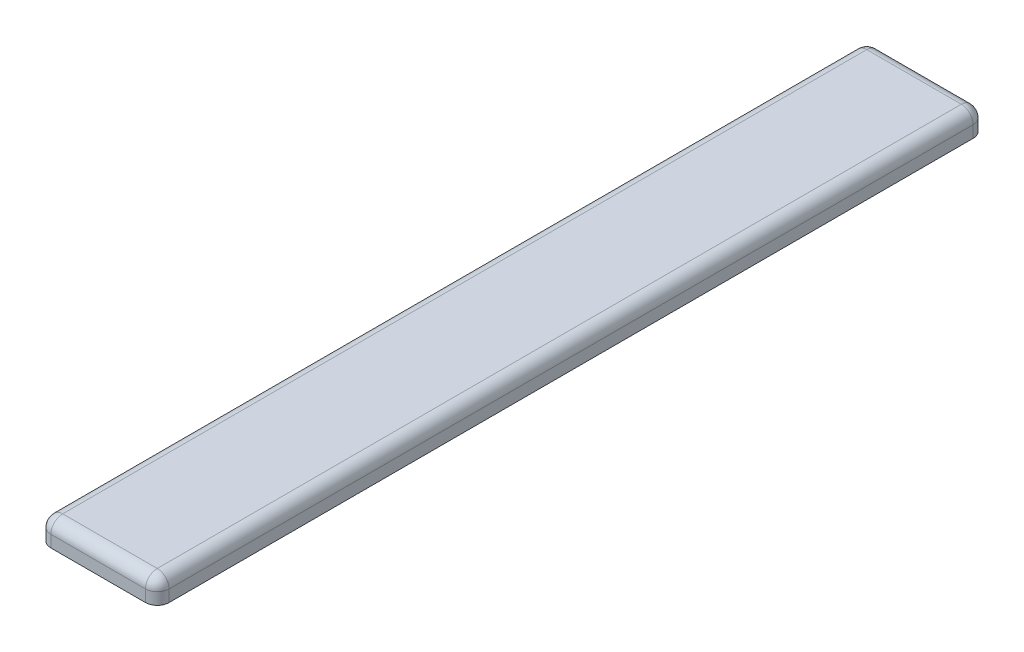
ISO-10303-21;
HEADER;
FILE_DESCRIPTION(('STEP AP214'),'2;1');
FILE_NAME('part.step','',(''),(''),'','','');
FILE_SCHEMA(('AUTOMOTIVE_DESIGN { 1 0 10303 214 1 1 1 1 }'));
ENDSEC;
DATA;
#1=APPLICATION_CONTEXT('core data for automotive mechanical design processes');
#2=APPLICATION_PROTOCOL_DEFINITION('international standard','automotive_design',2000,#1);
#3=PRODUCT_CONTEXT('',#1,'mechanical');
#4=PRODUCT('Part','Part','',(#3));
#5=PRODUCT_RELATED_PRODUCT_CATEGORY('part','',(#4));
#6=PRODUCT_DEFINITION_FORMATION('','',#4);
#7=PRODUCT_DEFINITION_CONTEXT('part definition',#1,'design');
#8=PRODUCT_DEFINITION('design','',#6,#7);
#9=PRODUCT_DEFINITION_SHAPE('','',#8);
#10=(LENGTH_UNIT() NAMED_UNIT(*) SI_UNIT(.MILLI.,.METRE.));
#11=(NAMED_UNIT(*) PLANE_ANGLE_UNIT() SI_UNIT($,.RADIAN.));
#12=(NAMED_UNIT(*) SI_UNIT($,.STERADIAN.) SOLID_ANGLE_UNIT());
#13=UNCERTAINTY_MEASURE_WITH_UNIT(LENGTH_MEASURE(1.E-05),#10,'distance_accuracy_value','');
#14=(GEOMETRIC_REPRESENTATION_CONTEXT(3) GLOBAL_UNCERTAINTY_ASSIGNED_CONTEXT((#13)) GLOBAL_UNIT_ASSIGNED_CONTEXT((#10,
#11,#12)) REPRESENTATION_CONTEXT('',''));
#15=CARTESIAN_POINT('',(0.,0.,0.));
#16=DIRECTION('',(0.,0.,1.));
#17=DIRECTION('',(1.,0.,0.));
#18=AXIS2_PLACEMENT_3D('',#15,#16,#17);
#19=CARTESIAN_POINT('',(0.,20.,0.));
#20=DIRECTION('',(1.,0.,0.));
#21=DIRECTION('',(0.,0.,-1.));
#22=AXIS2_PLACEMENT_3D('',#19,#20,#21);
#23=PLANE('',#22);
#24=DIRECTION('',(0.,0.,1.));
#25=VECTOR('',#24,1.);
#26=CARTESIAN_POINT('',(0.,0.,0.));
#27=LINE('',#26,#25);
#28=CARTESIAN_POINT('',(0.,0.,-690.));
#29=VERTEX_POINT('',#28);
#30=CARTESIAN_POINT('',(0.,0.,-10.));
#31=VERTEX_POINT('',#30);
#32=EDGE_CURVE('E198',#29,#31,#27,.T.);
#33=ORIENTED_EDGE('',*,*,#32,.T.);
#34=DIRECTION('',(0.,-1.,0.));
#35=VECTOR('',#34,1.);
#36=CARTESIAN_POINT('',(0.,20.,-10.));
#37=LINE('',#36,#35);
#38=CARTESIAN_POINT('',(0.,10.,-10.));
#39=VERTEX_POINT('',#38);
#40=EDGE_CURVE('E50',#31,#39,#37,.F.);
#41=ORIENTED_EDGE('',*,*,#40,.T.);
#42=DIRECTION('',(0.,0.,1.));
#43=VECTOR('',#42,1.);
#44=CARTESIAN_POINT('',(0.,10.,0.));
#45=LINE('',#44,#43);
#46=CARTESIAN_POINT('',(0.,10.,-690.));
#47=VERTEX_POINT('',#46);
#48=EDGE_CURVE('E55',#39,#47,#45,.F.);
#49=ORIENTED_EDGE('',*,*,#48,.T.);
#50=DIRECTION('',(0.,-1.,0.));
#51=VECTOR('',#50,1.);
#52=CARTESIAN_POINT('',(0.,20.,-690.));
#53=LINE('',#52,#51);
#54=EDGE_CURVE('E167',#47,#29,#53,.T.);
#55=ORIENTED_EDGE('',*,*,#54,.T.);
#56=EDGE_LOOP('',(#33,#41,#49,#55));
#57=FACE_BOUND('',#56,.T.);
#58=ADVANCED_FACE('F33',(#57),#23,.F.);
#59=CARTESIAN_POINT('',(0.,20.,0.));
#60=DIRECTION('',(0.,0.,-1.));
#61=DIRECTION('',(-1.,0.,0.));
#62=AXIS2_PLACEMENT_3D('',#59,#60,#61);
#63=PLANE('',#62);
#64=DIRECTION('',(1.,0.,0.));
#65=VECTOR('',#64,1.);
#66=CARTESIAN_POINT('',(0.,0.,0.));
#67=LINE('',#66,#65);
#68=CARTESIAN_POINT('',(10.,0.,0.));
#69=VERTEX_POINT('',#68);
#70=CARTESIAN_POINT('',(90.,0.,0.));
#71=VERTEX_POINT('',#70);
#72=EDGE_CURVE('E200',#69,#71,#67,.T.);
#73=ORIENTED_EDGE('',*,*,#72,.T.);
#74=DIRECTION('',(0.,-1.,0.));
#75=VECTOR('',#74,1.);
#76=CARTESIAN_POINT('',(90.,20.,0.));
#77=LINE('',#76,#75);
#78=CARTESIAN_POINT('',(90.,10.,0.));
#79=VERTEX_POINT('',#78);
#80=EDGE_CURVE('E165',#71,#79,#77,.F.);
#81=ORIENTED_EDGE('',*,*,#80,.T.);
#82=DIRECTION('',(1.,0.,0.));
#83=VECTOR('',#82,1.);
#84=CARTESIAN_POINT('',(0.,10.,0.));
#85=LINE('',#84,#83);
#86=CARTESIAN_POINT('',(10.,10.,0.));
#87=VERTEX_POINT('',#86);
#88=EDGE_CURVE('E163',#79,#87,#85,.F.);
#89=ORIENTED_EDGE('',*,*,#88,.T.);
#90=DIRECTION('',(0.,-1.,0.));
#91=VECTOR('',#90,1.);
#92=CARTESIAN_POINT('',(10.,20.,0.));
#93=LINE('',#92,#91);
#94=EDGE_CURVE('E161',#87,#69,#93,.T.);
#95=ORIENTED_EDGE('',*,*,#94,.T.);
#96=EDGE_LOOP('',(#73,#81,#89,#95));
#97=FACE_BOUND('',#96,.T.);
#98=ADVANCED_FACE('F253',(#97),#63,.F.);
#99=CARTESIAN_POINT('',(100.,20.,0.));
#100=DIRECTION('',(-1.,0.,0.));
#101=DIRECTION('',(0.,0.,1.));
#102=AXIS2_PLACEMENT_3D('',#99,#100,#101);
#103=PLANE('',#102);
#104=DIRECTION('',(0.,0.,-1.));
#105=VECTOR('',#104,1.);
#106=CARTESIAN_POINT('',(100.,10.,0.));
#107=LINE('',#106,#105);
#108=CARTESIAN_POINT('',(100.,10.,-690.));
#109=VERTEX_POINT('',#108);
#110=CARTESIAN_POINT('',(100.,10.,-10.));
#111=VERTEX_POINT('',#110);
#112=EDGE_CURVE('E157',#109,#111,#107,.F.);
#113=ORIENTED_EDGE('',*,*,#112,.T.);
#114=DIRECTION('',(0.,-1.,0.));
#115=VECTOR('',#114,1.);
#116=CARTESIAN_POINT('',(100.,20.,-10.));
#117=LINE('',#116,#115);
#118=CARTESIAN_POINT('',(100.,0.,-10.));
#119=VERTEX_POINT('',#118);
#120=EDGE_CURVE('E159',#111,#119,#117,.T.);
#121=ORIENTED_EDGE('',*,*,#120,.T.);
#122=DIRECTION('',(0.,0.,-1.));
#123=VECTOR('',#122,1.);
#124=CARTESIAN_POINT('',(100.,0.,0.));
#125=LINE('',#124,#123);
#126=CARTESIAN_POINT('',(100.,0.,-690.));
#127=VERTEX_POINT('',#126);
#128=EDGE_CURVE('E204',#119,#127,#125,.T.);
#129=ORIENTED_EDGE('',*,*,#128,.T.);
#130=DIRECTION('',(0.,-1.,0.));
#131=VECTOR('',#130,1.);
#132=CARTESIAN_POINT('',(100.,20.,-690.));
#133=LINE('',#132,#131);
#134=EDGE_CURVE('E155',#127,#109,#133,.F.);
#135=ORIENTED_EDGE('',*,*,#134,.T.);
#136=EDGE_LOOP('',(#113,#121,#129,#135));
#137=FACE_BOUND('',#136,.T.);
#138=ADVANCED_FACE('F258',(#137),#103,.F.);
#139=CARTESIAN_POINT('',(0.,20.,-700.));
#140=DIRECTION('',(0.,0.,1.));
#141=DIRECTION('',(1.,0.,0.));
#142=AXIS2_PLACEMENT_3D('',#139,#140,#141);
#143=PLANE('',#142);
#144=DIRECTION('',(-1.,0.,0.));
#145=VECTOR('',#144,1.);
#146=CARTESIAN_POINT('',(0.,10.,-700.));
#147=LINE('',#146,#145);
#148=CARTESIAN_POINT('',(10.,10.,-700.));
#149=VERTEX_POINT('',#148);
#150=CARTESIAN_POINT('',(90.,10.,-700.));
#151=VERTEX_POINT('',#150);
#152=EDGE_CURVE('E118',#149,#151,#147,.F.);
#153=ORIENTED_EDGE('',*,*,#152,.T.);
#154=DIRECTION('',(0.,-1.,0.));
#155=VECTOR('',#154,1.);
#156=CARTESIAN_POINT('',(90.,20.,-700.));
#157=LINE('',#156,#155);
#158=CARTESIAN_POINT('',(90.,0.,-700.));
#159=VERTEX_POINT('',#158);
#160=EDGE_CURVE('E153',#151,#159,#157,.T.);
#161=ORIENTED_EDGE('',*,*,#160,.T.);
#162=DIRECTION('',(-1.,0.,0.));
#163=VECTOR('',#162,1.);
#164=CARTESIAN_POINT('',(0.,0.,-700.));
#165=LINE('',#164,#163);
#166=CARTESIAN_POINT('',(10.,0.,-700.));
#167=VERTEX_POINT('',#166);
#168=EDGE_CURVE('E140',#159,#167,#165,.T.);
#169=ORIENTED_EDGE('',*,*,#168,.T.);
#170=DIRECTION('',(0.,-1.,0.));
#171=VECTOR('',#170,1.);
#172=CARTESIAN_POINT('',(10.,20.,-700.));
#173=LINE('',#172,#171);
#174=EDGE_CURVE('E146',#167,#149,#173,.F.);
#175=ORIENTED_EDGE('',*,*,#174,.T.);
#176=EDGE_LOOP('',(#153,#161,#169,#175));
#177=FACE_BOUND('',#176,.T.);
#178=ADVANCED_FACE('F229',(#177),#143,.F.);
#179=CARTESIAN_POINT('',(0.,20.,0.));
#180=DIRECTION('',(0.,-1.,0.));
#181=DIRECTION('',(0.,0.,-1.));
#182=AXIS2_PLACEMENT_3D('',#179,#180,#181);
#183=PLANE('',#182);
#184=DIRECTION('',(0.,0.,-1.));
#185=VECTOR('',#184,1.);
#186=CARTESIAN_POINT('',(90.,20.,0.));
#187=LINE('',#186,#185);
#188=CARTESIAN_POINT('',(90.,20.,-10.));
#189=VERTEX_POINT('',#188);
#190=CARTESIAN_POINT('',(90.,20.,-690.));
#191=VERTEX_POINT('',#190);
#192=EDGE_CURVE('E144',#189,#191,#187,.T.);
#193=ORIENTED_EDGE('',*,*,#192,.T.);
#194=DIRECTION('',(-1.,0.,0.));
#195=VECTOR('',#194,1.);
#196=CARTESIAN_POINT('',(0.,20.,-690.));
#197=LINE('',#196,#195);
#198=CARTESIAN_POINT('',(10.,20.,-690.));
#199=VERTEX_POINT('',#198);
#200=EDGE_CURVE('E116',#191,#199,#197,.T.);
#201=ORIENTED_EDGE('',*,*,#200,.T.);
#202=DIRECTION('',(0.,0.,1.));
#203=VECTOR('',#202,1.);
#204=CARTESIAN_POINT('',(10.,20.,0.));
#205=LINE('',#204,#203);
#206=CARTESIAN_POINT('',(10.,20.,-10.));
#207=VERTEX_POINT('',#206);
#208=EDGE_CURVE('E133',#199,#207,#205,.T.);
#209=ORIENTED_EDGE('',*,*,#208,.T.);
#210=DIRECTION('',(1.,0.,0.));
#211=VECTOR('',#210,1.);
#212=CARTESIAN_POINT('',(0.,20.,-10.));
#213=LINE('',#212,#211);
#214=EDGE_CURVE('E139',#207,#189,#213,.T.);
#215=ORIENTED_EDGE('',*,*,#214,.T.);
#216=EDGE_LOOP('',(#193,#201,#209,#215));
#217=FACE_BOUND('',#216,.T.);
#218=ADVANCED_FACE('F142',(#217),#183,.F.);
#219=CARTESIAN_POINT('',(0.,0.,0.));
#220=DIRECTION('',(0.,-1.,0.));
#221=DIRECTION('',(0.,0.,-1.));
#222=AXIS2_PLACEMENT_3D('',#219,#220,#221);
#223=PLANE('',#222);
#224=ORIENTED_EDGE('',*,*,#128,.F.);
#225=CARTESIAN_POINT('',(90.,0.,-10.));
#226=DIRECTION('',(0.,-1.,0.));
#227=DIRECTION('',(0.,0.,-1.));
#228=AXIS2_PLACEMENT_3D('',#225,#226,#227);
#229=CIRCLE('',#228,10.);
#230=EDGE_CURVE('E11',#119,#71,#229,.T.);
#231=ORIENTED_EDGE('',*,*,#230,.T.);
#232=ORIENTED_EDGE('',*,*,#72,.F.);
#233=CARTESIAN_POINT('',(10.,0.,-10.));
#234=DIRECTION('',(0.,-1.,0.));
#235=DIRECTION('',(0.,0.,-1.));
#236=AXIS2_PLACEMENT_3D('',#233,#234,#235);
#237=CIRCLE('',#236,10.);
#238=EDGE_CURVE('E42',#69,#31,#237,.T.);
#239=ORIENTED_EDGE('',*,*,#238,.T.);
#240=ORIENTED_EDGE('',*,*,#32,.F.);
#241=CARTESIAN_POINT('',(10.,0.,-690.));
#242=DIRECTION('',(0.,-1.,0.));
#243=DIRECTION('',(0.,0.,-1.));
#244=AXIS2_PLACEMENT_3D('',#241,#242,#243);
#245=CIRCLE('',#244,10.);
#246=EDGE_CURVE('E171',#29,#167,#245,.T.);
#247=ORIENTED_EDGE('',*,*,#246,.T.);
#248=ORIENTED_EDGE('',*,*,#168,.F.);
#249=CARTESIAN_POINT('',(90.,0.,-690.));
#250=DIRECTION('',(0.,-1.,0.));
#251=DIRECTION('',(0.,0.,-1.));
#252=AXIS2_PLACEMENT_3D('',#249,#250,#251);
#253=CIRCLE('',#252,10.);
#254=EDGE_CURVE('E173',#159,#127,#253,.T.);
#255=ORIENTED_EDGE('',*,*,#254,.T.);
#256=EDGE_LOOP('',(#224,#231,#232,#239,#240,#247,#248,#255));
#257=FACE_BOUND('',#256,.T.);
#258=ADVANCED_FACE('F236',(#257),#223,.T.);
#259=CARTESIAN_POINT('',(90.,20.,-10.));
#260=DIRECTION('',(0.,-1.,0.));
#261=DIRECTION('',(0.,0.,-1.));
#262=AXIS2_PLACEMENT_3D('',#259,#260,#261);
#263=CYLINDRICAL_SURFACE('',#262,10.);
#264=ORIENTED_EDGE('',*,*,#230,.F.);
#265=ORIENTED_EDGE('',*,*,#120,.F.);
#266=CARTESIAN_POINT('',(90.,10.,-10.));
#267=DIRECTION('',(0.,1.,0.));
#268=DIRECTION('',(0.,0.,1.));
#269=AXIS2_PLACEMENT_3D('',#266,#267,#268);
#270=CIRCLE('',#269,10.);
#271=EDGE_CURVE('E37',#79,#111,#270,.T.);
#272=ORIENTED_EDGE('',*,*,#271,.F.);
#273=ORIENTED_EDGE('',*,*,#80,.F.);
#274=EDGE_LOOP('',(#264,#265,#272,#273));
#275=FACE_BOUND('',#274,.T.);
#276=ADVANCED_FACE('F35',(#275),#263,.T.);
#277=CARTESIAN_POINT('',(0.,10.,-10.));
#278=DIRECTION('',(1.,0.,0.));
#279=DIRECTION('',(0.,0.,-1.));
#280=AXIS2_PLACEMENT_3D('',#277,#278,#279);
#281=CYLINDRICAL_SURFACE('',#280,10.);
#282=CARTESIAN_POINT('',(10.,10.,-10.));
#283=DIRECTION('',(-1.,0.,0.));
#284=DIRECTION('',(0.,0.,1.));
#285=AXIS2_PLACEMENT_3D('',#282,#283,#284);
#286=CIRCLE('',#285,10.);
#287=EDGE_CURVE('E190',#87,#207,#286,.T.);
#288=ORIENTED_EDGE('',*,*,#287,.F.);
#289=ORIENTED_EDGE('',*,*,#88,.F.);
#290=CARTESIAN_POINT('',(90.,10.,-10.));
#291=DIRECTION('',(1.,0.,0.));
#292=DIRECTION('',(0.,0.,-1.));
#293=AXIS2_PLACEMENT_3D('',#290,#291,#292);
#294=CIRCLE('',#293,10.);
#295=EDGE_CURVE('E192',#189,#79,#294,.T.);
#296=ORIENTED_EDGE('',*,*,#295,.F.);
#297=ORIENTED_EDGE('',*,*,#214,.F.);
#298=EDGE_LOOP('',(#288,#289,#296,#297));
#299=FACE_BOUND('',#298,.T.);
#300=ADVANCED_FACE('F213',(#299),#281,.T.);
#301=CARTESIAN_POINT('',(10.,20.,-10.));
#302=DIRECTION('',(0.,-1.,0.));
#303=DIRECTION('',(0.,0.,-1.));
#304=AXIS2_PLACEMENT_3D('',#301,#302,#303);
#305=CYLINDRICAL_SURFACE('',#304,10.);
#306=ORIENTED_EDGE('',*,*,#238,.F.);
#307=ORIENTED_EDGE('',*,*,#94,.F.);
#308=CARTESIAN_POINT('',(10.,10.,-10.));
#309=DIRECTION('',(0.,1.,0.));
#310=DIRECTION('',(0.,0.,1.));
#311=AXIS2_PLACEMENT_3D('',#308,#309,#310);
#312=CIRCLE('',#311,10.);
#313=EDGE_CURVE('E187',#39,#87,#312,.T.);
#314=ORIENTED_EDGE('',*,*,#313,.F.);
#315=ORIENTED_EDGE('',*,*,#40,.F.);
#316=EDGE_LOOP('',(#306,#307,#314,#315));
#317=FACE_BOUND('',#316,.T.);
#318=ADVANCED_FACE('F241',(#317),#305,.T.);
#319=CARTESIAN_POINT('',(90.,10.,-10.));
#320=DIRECTION('',(0.,0.,1.));
#321=DIRECTION('',(1.,0.,0.));
#322=AXIS2_PLACEMENT_3D('',#319,#320,#321);
#323=SPHERICAL_SURFACE('',#322,10.);
#324=ORIENTED_EDGE('',*,*,#295,.T.);
#325=ORIENTED_EDGE('',*,*,#271,.T.);
#326=CARTESIAN_POINT('',(90.,10.,-10.));
#327=DIRECTION('',(0.,0.,1.));
#328=DIRECTION('',(1.,0.,0.));
#329=AXIS2_PLACEMENT_3D('',#326,#327,#328);
#330=CIRCLE('',#329,10.);
#331=EDGE_CURVE('E184',#189,#111,#330,.F.);
#332=ORIENTED_EDGE('',*,*,#331,.F.);
#333=EDGE_LOOP('',(#324,#325,#332));
#334=FACE_BOUND('',#333,.T.);
#335=ADVANCED_FACE('F214',(#334),#323,.T.);
#336=CARTESIAN_POINT('',(10.,10.,-10.));
#337=DIRECTION('',(0.,0.,1.));
#338=DIRECTION('',(1.,0.,0.));
#339=AXIS2_PLACEMENT_3D('',#336,#337,#338);
#340=SPHERICAL_SURFACE('',#339,10.);
#341=ORIENTED_EDGE('',*,*,#313,.T.);
#342=ORIENTED_EDGE('',*,*,#287,.T.);
#343=CARTESIAN_POINT('',(10.,10.,-10.));
#344=DIRECTION('',(0.,0.,1.));
#345=DIRECTION('',(1.,0.,0.));
#346=AXIS2_PLACEMENT_3D('',#343,#344,#345);
#347=CIRCLE('',#346,10.);
#348=EDGE_CURVE('E136',#39,#207,#347,.F.);
#349=ORIENTED_EDGE('',*,*,#348,.F.);
#350=EDGE_LOOP('',(#341,#342,#349));
#351=FACE_BOUND('',#350,.T.);
#352=ADVANCED_FACE('F243',(#351),#340,.T.);
#353=CARTESIAN_POINT('',(90.,20.,-690.));
#354=DIRECTION('',(0.,-1.,0.));
#355=DIRECTION('',(0.,0.,-1.));
#356=AXIS2_PLACEMENT_3D('',#353,#354,#355);
#357=CYLINDRICAL_SURFACE('',#356,10.);
#358=ORIENTED_EDGE('',*,*,#254,.F.);
#359=ORIENTED_EDGE('',*,*,#160,.F.);
#360=CARTESIAN_POINT('',(90.,10.,-690.));
#361=DIRECTION('',(0.,1.,0.));
#362=DIRECTION('',(0.,0.,1.));
#363=AXIS2_PLACEMENT_3D('',#360,#361,#362);
#364=CIRCLE('',#363,10.);
#365=EDGE_CURVE('E180',#109,#151,#364,.T.);
#366=ORIENTED_EDGE('',*,*,#365,.F.);
#367=ORIENTED_EDGE('',*,*,#134,.F.);
#368=EDGE_LOOP('',(#358,#359,#366,#367));
#369=FACE_BOUND('',#368,.T.);
#370=ADVANCED_FACE('F226',(#369),#357,.T.);
#371=CARTESIAN_POINT('',(90.,10.,0.));
#372=DIRECTION('',(0.,0.,-1.));
#373=DIRECTION('',(-1.,0.,0.));
#374=AXIS2_PLACEMENT_3D('',#371,#372,#373);
#375=CYLINDRICAL_SURFACE('',#374,10.);
#376=ORIENTED_EDGE('',*,*,#331,.T.);
#377=ORIENTED_EDGE('',*,*,#112,.F.);
#378=CARTESIAN_POINT('',(90.,10.,-690.));
#379=DIRECTION('',(0.,0.,-1.));
#380=DIRECTION('',(-1.,0.,0.));
#381=AXIS2_PLACEMENT_3D('',#378,#379,#380);
#382=CIRCLE('',#381,10.);
#383=EDGE_CURVE('E130',#191,#109,#382,.T.);
#384=ORIENTED_EDGE('',*,*,#383,.F.);
#385=ORIENTED_EDGE('',*,*,#192,.F.);
#386=EDGE_LOOP('',(#376,#377,#384,#385));
#387=FACE_BOUND('',#386,.T.);
#388=ADVANCED_FACE('F217',(#387),#375,.T.);
#389=CARTESIAN_POINT('',(10.,10.,0.));
#390=DIRECTION('',(0.,0.,1.));
#391=DIRECTION('',(1.,0.,0.));
#392=AXIS2_PLACEMENT_3D('',#389,#390,#391);
#393=CYLINDRICAL_SURFACE('',#392,10.);
#394=ORIENTED_EDGE('',*,*,#348,.T.);
#395=ORIENTED_EDGE('',*,*,#208,.F.);
#396=CARTESIAN_POINT('',(10.,10.,-690.));
#397=DIRECTION('',(0.,0.,-1.));
#398=DIRECTION('',(-1.,0.,0.));
#399=AXIS2_PLACEMENT_3D('',#396,#397,#398);
#400=CIRCLE('',#399,10.);
#401=EDGE_CURVE('E124',#47,#199,#400,.T.);
#402=ORIENTED_EDGE('',*,*,#401,.F.);
#403=ORIENTED_EDGE('',*,*,#48,.F.);
#404=EDGE_LOOP('',(#394,#395,#402,#403));
#405=FACE_BOUND('',#404,.T.);
#406=ADVANCED_FACE('F134',(#405),#393,.T.);
#407=CARTESIAN_POINT('',(10.,20.,-690.));
#408=DIRECTION('',(0.,-1.,0.));
#409=DIRECTION('',(0.,0.,-1.));
#410=AXIS2_PLACEMENT_3D('',#407,#408,#409);
#411=CYLINDRICAL_SURFACE('',#410,10.);
#412=ORIENTED_EDGE('',*,*,#246,.F.);
#413=ORIENTED_EDGE('',*,*,#54,.F.);
#414=CARTESIAN_POINT('',(10.,10.,-690.));
#415=DIRECTION('',(0.,1.,0.));
#416=DIRECTION('',(0.,0.,1.));
#417=AXIS2_PLACEMENT_3D('',#414,#415,#416);
#418=CIRCLE('',#417,10.);
#419=EDGE_CURVE('E128',#149,#47,#418,.T.);
#420=ORIENTED_EDGE('',*,*,#419,.F.);
#421=ORIENTED_EDGE('',*,*,#174,.F.);
#422=EDGE_LOOP('',(#412,#413,#420,#421));
#423=FACE_BOUND('',#422,.T.);
#424=ADVANCED_FACE('F233',(#423),#411,.T.);
#425=CARTESIAN_POINT('',(90.,10.,-690.));
#426=DIRECTION('',(0.,0.,1.));
#427=DIRECTION('',(1.,0.,0.));
#428=AXIS2_PLACEMENT_3D('',#425,#426,#427);
#429=SPHERICAL_SURFACE('',#428,10.);
#430=ORIENTED_EDGE('',*,*,#383,.T.);
#431=ORIENTED_EDGE('',*,*,#365,.T.);
#432=CARTESIAN_POINT('',(90.,10.,-690.));
#433=DIRECTION('',(1.,0.,0.));
#434=DIRECTION('',(0.,0.,-1.));
#435=AXIS2_PLACEMENT_3D('',#432,#433,#434);
#436=CIRCLE('',#435,10.);
#437=EDGE_CURVE('E121',#191,#151,#436,.F.);
#438=ORIENTED_EDGE('',*,*,#437,.F.);
#439=EDGE_LOOP('',(#430,#431,#438));
#440=FACE_BOUND('',#439,.T.);
#441=ADVANCED_FACE('F221',(#440),#429,.T.);
#442=CARTESIAN_POINT('',(10.,10.,-690.));
#443=DIRECTION('',(0.,0.,1.));
#444=DIRECTION('',(1.,0.,0.));
#445=AXIS2_PLACEMENT_3D('',#442,#443,#444);
#446=SPHERICAL_SURFACE('',#445,10.);
#447=ORIENTED_EDGE('',*,*,#419,.T.);
#448=ORIENTED_EDGE('',*,*,#401,.T.);
#449=CARTESIAN_POINT('',(10.,10.,-690.));
#450=DIRECTION('',(-1.,0.,0.));
#451=DIRECTION('',(0.,0.,1.));
#452=AXIS2_PLACEMENT_3D('',#449,#450,#451);
#453=CIRCLE('',#452,10.);
#454=EDGE_CURVE('E112',#149,#199,#453,.F.);
#455=ORIENTED_EDGE('',*,*,#454,.F.);
#456=EDGE_LOOP('',(#447,#448,#455));
#457=FACE_BOUND('',#456,.T.);
#458=ADVANCED_FACE('F126',(#457),#446,.T.);
#459=CARTESIAN_POINT('',(0.,10.,-690.));
#460=DIRECTION('',(-1.,0.,0.));
#461=DIRECTION('',(0.,0.,1.));
#462=AXIS2_PLACEMENT_3D('',#459,#460,#461);
#463=CYLINDRICAL_SURFACE('',#462,10.);
#464=ORIENTED_EDGE('',*,*,#437,.T.);
#465=ORIENTED_EDGE('',*,*,#152,.F.);
#466=ORIENTED_EDGE('',*,*,#454,.T.);
#467=ORIENTED_EDGE('',*,*,#200,.F.);
#468=EDGE_LOOP('',(#464,#465,#466,#467));
#469=FACE_BOUND('',#468,.T.);
#470=ADVANCED_FACE('F114',(#469),#463,.T.);
#471=CLOSED_SHELL('',(#58,#98,#138,#178,#218,#258,#276,#300,#318,#335,#352,#370,#388,#406,#424,
#441,#458,#470));
#472=MANIFOLD_SOLID_BREP('B2',#471);
#473=ADVANCED_BREP_SHAPE_REPRESENTATION('',(#18,#472),#14);
#474=SHAPE_DEFINITION_REPRESENTATION(#9,#473);
ENDSEC;
END-ISO-10303-21;
